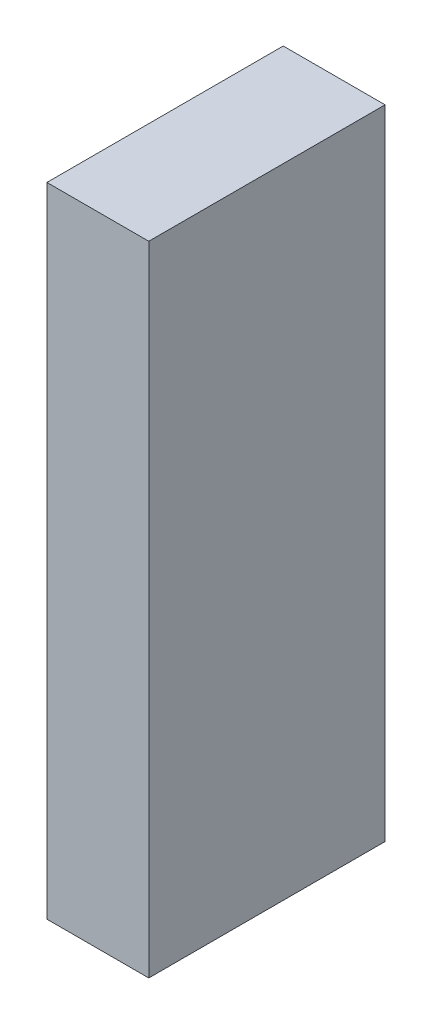
ISO-10303-21;
HEADER;
FILE_DESCRIPTION(('STEP AP214'),'2;1');
FILE_NAME('part.step','',(''),(''),'','','');
FILE_SCHEMA(('AUTOMOTIVE_DESIGN { 1 0 10303 214 1 1 1 1 }'));
ENDSEC;
DATA;
#1=APPLICATION_CONTEXT('core data for automotive mechanical design processes');
#2=APPLICATION_PROTOCOL_DEFINITION('international standard','automotive_design',2000,#1);
#3=PRODUCT_CONTEXT('',#1,'mechanical');
#4=PRODUCT('Part','Part','',(#3));
#5=PRODUCT_RELATED_PRODUCT_CATEGORY('part','',(#4));
#6=PRODUCT_DEFINITION_FORMATION('','',#4);
#7=PRODUCT_DEFINITION_CONTEXT('part definition',#1,'design');
#8=PRODUCT_DEFINITION('design','',#6,#7);
#9=PRODUCT_DEFINITION_SHAPE('','',#8);
#10=(LENGTH_UNIT() NAMED_UNIT(*) SI_UNIT(.MILLI.,.METRE.));
#11=(NAMED_UNIT(*) PLANE_ANGLE_UNIT() SI_UNIT($,.RADIAN.));
#12=(NAMED_UNIT(*) SI_UNIT($,.STERADIAN.) SOLID_ANGLE_UNIT());
#13=UNCERTAINTY_MEASURE_WITH_UNIT(LENGTH_MEASURE(1.E-05),#10,'distance_accuracy_value','');
#14=(GEOMETRIC_REPRESENTATION_CONTEXT(3) GLOBAL_UNCERTAINTY_ASSIGNED_CONTEXT((#13)) GLOBAL_UNIT_ASSIGNED_CONTEXT((#10,
#11,#12)) REPRESENTATION_CONTEXT('',''));
#15=CARTESIAN_POINT('',(0.,0.,0.));
#16=DIRECTION('',(0.,0.,1.));
#17=DIRECTION('',(1.,0.,0.));
#18=AXIS2_PLACEMENT_3D('',#15,#16,#17);
#19=CARTESIAN_POINT('',(3.0355,1.35,0.));
#20=DIRECTION('',(1.,0.,0.));
#21=DIRECTION('',(0.,0.,-1.));
#22=AXIS2_PLACEMENT_3D('',#19,#20,#21);
#23=PLANE('',#22);
#24=DIRECTION('',(0.,0.,-1.));
#25=VECTOR('',#24,1.);
#26=CARTESIAN_POINT('',(3.0355,-1.35,0.));
#27=LINE('',#26,#25);
#28=CARTESIAN_POINT('',(3.0355,-1.35,0.));
#29=VERTEX_POINT('',#28);
#30=CARTESIAN_POINT('',(3.0355,-1.35,1.));
#31=VERTEX_POINT('',#30);
#32=EDGE_CURVE('E20',#29,#31,#27,.F.);
#33=ORIENTED_EDGE('',*,*,#32,.F.);
#34=DIRECTION('',(0.,1.,0.));
#35=VECTOR('',#34,1.);
#36=CARTESIAN_POINT('',(3.0355,-1.35,0.));
#37=LINE('',#36,#35);
#38=CARTESIAN_POINT('',(3.0355,1.35,0.));
#39=VERTEX_POINT('',#38);
#40=EDGE_CURVE('E80',#29,#39,#37,.T.);
#41=ORIENTED_EDGE('',*,*,#40,.T.);
#42=DIRECTION('',(0.,0.,1.));
#43=VECTOR('',#42,1.);
#44=CARTESIAN_POINT('',(3.0355,1.35,0.));
#45=LINE('',#44,#43);
#46=CARTESIAN_POINT('',(3.0355,1.35,1.));
#47=VERTEX_POINT('',#46);
#48=EDGE_CURVE('E68',#47,#39,#45,.F.);
#49=ORIENTED_EDGE('',*,*,#48,.F.);
#50=DIRECTION('',(0.,1.,0.));
#51=VECTOR('',#50,1.);
#52=CARTESIAN_POINT('',(3.0355,-1.35,1.));
#53=LINE('',#52,#51);
#54=EDGE_CURVE('E56',#31,#47,#53,.T.);
#55=ORIENTED_EDGE('',*,*,#54,.F.);
#56=EDGE_LOOP('',(#33,#41,#49,#55));
#57=FACE_BOUND('',#56,.T.);
#58=ADVANCED_FACE('F17',(#57),#23,.T.);
#59=CARTESIAN_POINT('',(3.0355,-1.35,0.));
#60=DIRECTION('',(0.,-1.,0.));
#61=DIRECTION('',(0.,0.,-1.));
#62=AXIS2_PLACEMENT_3D('',#59,#60,#61);
#63=PLANE('',#62);
#64=DIRECTION('',(0.,0.,1.));
#65=VECTOR('',#64,1.);
#66=CARTESIAN_POINT('',(2.6045,-1.35,0.));
#67=LINE('',#66,#65);
#68=CARTESIAN_POINT('',(2.6045,-1.35,0.));
#69=VERTEX_POINT('',#68);
#70=CARTESIAN_POINT('',(2.6045,-1.35,1.));
#71=VERTEX_POINT('',#70);
#72=EDGE_CURVE('E83',#69,#71,#67,.T.);
#73=ORIENTED_EDGE('',*,*,#72,.F.);
#74=DIRECTION('',(1.,0.,0.));
#75=VECTOR('',#74,1.);
#76=CARTESIAN_POINT('',(2.6045,-1.35,0.));
#77=LINE('',#76,#75);
#78=EDGE_CURVE('E65',#69,#29,#77,.T.);
#79=ORIENTED_EDGE('',*,*,#78,.T.);
#80=ORIENTED_EDGE('',*,*,#32,.T.);
#81=DIRECTION('',(1.,0.,0.));
#82=VECTOR('',#81,1.);
#83=CARTESIAN_POINT('',(2.6045,-1.35,1.));
#84=LINE('',#83,#82);
#85=EDGE_CURVE('E62',#71,#31,#84,.T.);
#86=ORIENTED_EDGE('',*,*,#85,.F.);
#87=EDGE_LOOP('',(#73,#79,#80,#86));
#88=FACE_BOUND('',#87,.T.);
#89=ADVANCED_FACE('F61',(#88),#63,.T.);
#90=CARTESIAN_POINT('',(2.6045,-1.35,1.));
#91=DIRECTION('',(0.,0.,1.));
#92=DIRECTION('',(1.,0.,0.));
#93=AXIS2_PLACEMENT_3D('',#90,#91,#92);
#94=PLANE('',#93);
#95=DIRECTION('',(1.,0.,0.));
#96=VECTOR('',#95,1.);
#97=CARTESIAN_POINT('',(2.6045,1.35,1.));
#98=LINE('',#97,#96);
#99=CARTESIAN_POINT('',(2.6045,1.35,1.));
#100=VERTEX_POINT('',#99);
#101=EDGE_CURVE('E70',#100,#47,#98,.T.);
#102=ORIENTED_EDGE('',*,*,#101,.F.);
#103=DIRECTION('',(0.,1.,0.));
#104=VECTOR('',#103,1.);
#105=CARTESIAN_POINT('',(2.6045,-1.35,1.));
#106=LINE('',#105,#104);
#107=EDGE_CURVE('E74',#71,#100,#106,.T.);
#108=ORIENTED_EDGE('',*,*,#107,.F.);
#109=ORIENTED_EDGE('',*,*,#85,.T.);
#110=ORIENTED_EDGE('',*,*,#54,.T.);
#111=EDGE_LOOP('',(#102,#108,#109,#110));
#112=FACE_BOUND('',#111,.T.);
#113=ADVANCED_FACE('F72',(#112),#94,.T.);
#114=CARTESIAN_POINT('',(2.6045,1.35,0.));
#115=DIRECTION('',(0.,1.,0.));
#116=DIRECTION('',(0.,0.,1.));
#117=AXIS2_PLACEMENT_3D('',#114,#115,#116);
#118=PLANE('',#117);
#119=ORIENTED_EDGE('',*,*,#48,.T.);
#120=DIRECTION('',(1.,0.,0.));
#121=VECTOR('',#120,1.);
#122=CARTESIAN_POINT('',(2.6045,1.35,0.));
#123=LINE('',#122,#121);
#124=CARTESIAN_POINT('',(2.6045,1.35,0.));
#125=VERTEX_POINT('',#124);
#126=EDGE_CURVE('E35',#39,#125,#123,.F.);
#127=ORIENTED_EDGE('',*,*,#126,.T.);
#128=DIRECTION('',(0.,0.,1.));
#129=VECTOR('',#128,1.);
#130=CARTESIAN_POINT('',(2.6045,1.35,0.));
#131=LINE('',#130,#129);
#132=EDGE_CURVE('E26',#100,#125,#131,.F.);
#133=ORIENTED_EDGE('',*,*,#132,.F.);
#134=ORIENTED_EDGE('',*,*,#101,.T.);
#135=EDGE_LOOP('',(#119,#127,#133,#134));
#136=FACE_BOUND('',#135,.T.);
#137=ADVANCED_FACE('F89',(#136),#118,.T.);
#138=CARTESIAN_POINT('',(2.6045,-1.35,0.));
#139=DIRECTION('',(0.,0.,1.));
#140=DIRECTION('',(1.,0.,0.));
#141=AXIS2_PLACEMENT_3D('',#138,#139,#140);
#142=PLANE('',#141);
#143=ORIENTED_EDGE('',*,*,#126,.F.);
#144=ORIENTED_EDGE('',*,*,#40,.F.);
#145=ORIENTED_EDGE('',*,*,#78,.F.);
#146=DIRECTION('',(0.,1.,0.));
#147=VECTOR('',#146,1.);
#148=CARTESIAN_POINT('',(2.6045,-1.35,0.));
#149=LINE('',#148,#147);
#150=EDGE_CURVE('E11',#125,#69,#149,.F.);
#151=ORIENTED_EDGE('',*,*,#150,.F.);
#152=EDGE_LOOP('',(#143,#144,#145,#151));
#153=FACE_BOUND('',#152,.T.);
#154=ADVANCED_FACE('F91',(#153),#142,.F.);
#155=CARTESIAN_POINT('',(2.6045,-1.35,0.));
#156=DIRECTION('',(-1.,0.,0.));
#157=DIRECTION('',(0.,0.,1.));
#158=AXIS2_PLACEMENT_3D('',#155,#156,#157);
#159=PLANE('',#158);
#160=ORIENTED_EDGE('',*,*,#132,.T.);
#161=ORIENTED_EDGE('',*,*,#150,.T.);
#162=ORIENTED_EDGE('',*,*,#72,.T.);
#163=ORIENTED_EDGE('',*,*,#107,.T.);
#164=EDGE_LOOP('',(#160,#161,#162,#163));
#165=FACE_BOUND('',#164,.T.);
#166=ADVANCED_FACE('F88',(#165),#159,.T.);
#167=CLOSED_SHELL('',(#58,#89,#113,#137,#154,#166));
#168=MANIFOLD_SOLID_BREP('B1',#167);
#169=ADVANCED_BREP_SHAPE_REPRESENTATION('',(#18,#168),#14);
#170=SHAPE_DEFINITION_REPRESENTATION(#9,#169);
ENDSEC;
END-ISO-10303-21;
